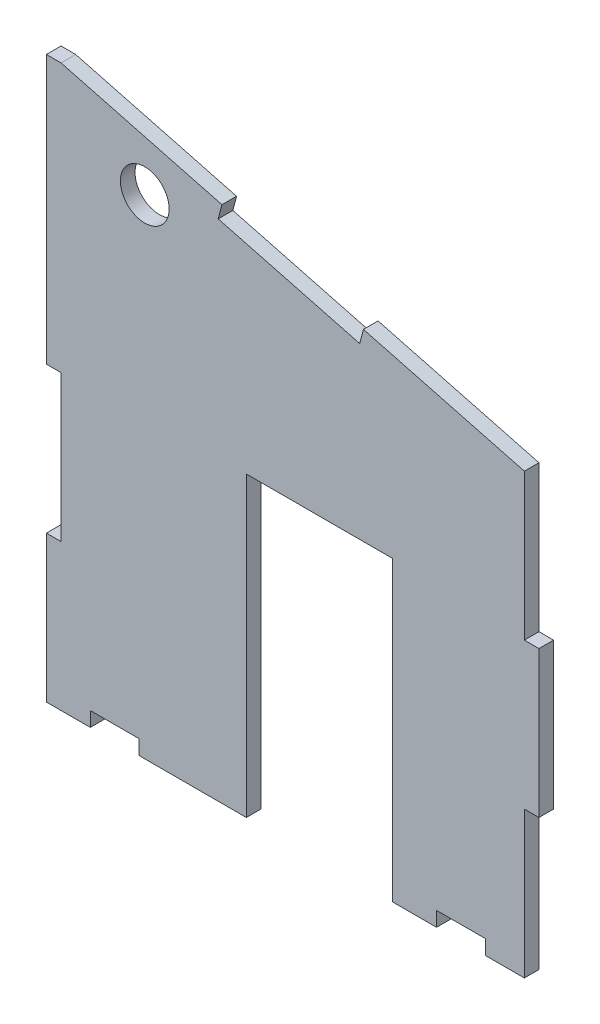
ISO-10303-21;
HEADER;
FILE_DESCRIPTION(('STEP AP214'),'2;1');
FILE_NAME('part.step','',(''),(''),'','','');
FILE_SCHEMA(('AUTOMOTIVE_DESIGN { 1 0 10303 214 1 1 1 1 }'));
ENDSEC;
DATA;
#1=APPLICATION_CONTEXT('core data for automotive mechanical design processes');
#2=APPLICATION_PROTOCOL_DEFINITION('international standard','automotive_design',2000,#1);
#3=PRODUCT_CONTEXT('',#1,'mechanical');
#4=PRODUCT('Part','Part','',(#3));
#5=PRODUCT_RELATED_PRODUCT_CATEGORY('part','',(#4));
#6=PRODUCT_DEFINITION_FORMATION('','',#4);
#7=PRODUCT_DEFINITION_CONTEXT('part definition',#1,'design');
#8=PRODUCT_DEFINITION('design','',#6,#7);
#9=PRODUCT_DEFINITION_SHAPE('','',#8);
#10=(LENGTH_UNIT() NAMED_UNIT(*) SI_UNIT(.MILLI.,.METRE.));
#11=(NAMED_UNIT(*) PLANE_ANGLE_UNIT() SI_UNIT($,.RADIAN.));
#12=(NAMED_UNIT(*) SI_UNIT($,.STERADIAN.) SOLID_ANGLE_UNIT());
#13=UNCERTAINTY_MEASURE_WITH_UNIT(LENGTH_MEASURE(1.E-05),#10,'distance_accuracy_value','');
#14=(GEOMETRIC_REPRESENTATION_CONTEXT(3) GLOBAL_UNCERTAINTY_ASSIGNED_CONTEXT((#13)) GLOBAL_UNIT_ASSIGNED_CONTEXT((#10,
#11,#12)) REPRESENTATION_CONTEXT('',''));
#15=CARTESIAN_POINT('',(0.,0.,0.));
#16=DIRECTION('',(0.,0.,1.));
#17=DIRECTION('',(1.,0.,0.));
#18=AXIS2_PLACEMENT_3D('',#15,#16,#17);
#19=CARTESIAN_POINT('',(0.,0.,3.));
#20=DIRECTION('',(0.,0.,1.));
#21=DIRECTION('',(1.,0.,0.));
#22=AXIS2_PLACEMENT_3D('',#19,#20,#21);
#23=PLANE('',#22);
#24=DIRECTION('',(-0.967074537262647,0.254493299279643,0.));
#25=VECTOR('',#24,1.);
#26=CARTESIAN_POINT('',(287.68406080118,245.441152462418,3.));
#27=LINE('',#26,#25);
#28=CARTESIAN_POINT('',(287.68406080118,245.441152462418,3.));
#29=VERTEX_POINT('',#28);
#30=CARTESIAN_POINT('',(254.690178860119,254.123752973223,3.));
#31=VERTEX_POINT('',#30);
#32=EDGE_CURVE('E315',#29,#31,#27,.T.);
#33=ORIENTED_EDGE('',*,*,#32,.T.);
#34=DIRECTION('',(-1.,0.,0.));
#35=VECTOR('',#34,1.);
#36=CARTESIAN_POINT('',(251.69017886012,254.123752973223,3.));
#37=LINE('',#36,#35);
#38=CARTESIAN_POINT('',(251.69017886012,254.123752973223,3.));
#39=VERTEX_POINT('',#38);
#40=EDGE_CURVE('E158',#31,#39,#37,.T.);
#41=ORIENTED_EDGE('',*,*,#40,.T.);
#42=DIRECTION('',(0.,-1.,0.));
#43=VECTOR('',#42,1.);
#44=CARTESIAN_POINT('',(251.69017886012,254.123752973223,3.));
#45=LINE('',#44,#43);
#46=CARTESIAN_POINT('',(251.69017886012,199.123752973223,3.));
#47=VERTEX_POINT('',#46);
#48=EDGE_CURVE('E393',#39,#47,#45,.T.);
#49=ORIENTED_EDGE('',*,*,#48,.T.);
#50=DIRECTION('',(1.,0.,0.));
#51=VECTOR('',#50,1.);
#52=CARTESIAN_POINT('',(251.69017886012,199.123752973223,3.));
#53=LINE('',#52,#51);
#54=CARTESIAN_POINT('',(254.690178860119,199.123752973223,3.));
#55=VERTEX_POINT('',#54);
#56=EDGE_CURVE('E412',#47,#55,#53,.T.);
#57=ORIENTED_EDGE('',*,*,#56,.T.);
#58=DIRECTION('',(0.,-1.,0.));
#59=VECTOR('',#58,1.);
#60=CARTESIAN_POINT('',(254.690178860119,199.123752973223,3.));
#61=LINE('',#60,#59);
#62=CARTESIAN_POINT('',(254.690178860119,169.123752973223,3.));
#63=VERTEX_POINT('',#62);
#64=EDGE_CURVE('E409',#55,#63,#61,.T.);
#65=ORIENTED_EDGE('',*,*,#64,.T.);
#66=DIRECTION('',(-1.,0.,0.));
#67=VECTOR('',#66,1.);
#68=CARTESIAN_POINT('',(254.690178860119,169.123752973223,3.));
#69=LINE('',#68,#67);
#70=CARTESIAN_POINT('',(251.690178860119,169.123752973223,3.));
#71=VERTEX_POINT('',#70);
#72=EDGE_CURVE('E411',#63,#71,#69,.T.);
#73=ORIENTED_EDGE('',*,*,#72,.T.);
#74=DIRECTION('',(0.,-1.,0.));
#75=VECTOR('',#74,1.);
#76=CARTESIAN_POINT('',(251.690178860119,169.123752973223,3.));
#77=LINE('',#76,#75);
#78=CARTESIAN_POINT('',(251.690178860119,139.123752973223,3.));
#79=VERTEX_POINT('',#78);
#80=EDGE_CURVE('E414',#71,#79,#77,.T.);
#81=ORIENTED_EDGE('',*,*,#80,.T.);
#82=DIRECTION('',(1.,0.,0.));
#83=VECTOR('',#82,1.);
#84=CARTESIAN_POINT('',(251.690178860119,139.123752973223,3.));
#85=LINE('',#84,#83);
#86=CARTESIAN_POINT('',(260.690178860119,139.123752973223,3.));
#87=VERTEX_POINT('',#86);
#88=EDGE_CURVE('E420',#79,#87,#85,.T.);
#89=ORIENTED_EDGE('',*,*,#88,.T.);
#90=DIRECTION('',(0.,1.,0.));
#91=VECTOR('',#90,1.);
#92=CARTESIAN_POINT('',(260.690178860119,139.123752973223,3.));
#93=LINE('',#92,#91);
#94=CARTESIAN_POINT('',(260.690178860119,142.123752973223,3.));
#95=VERTEX_POINT('',#94);
#96=EDGE_CURVE('E422',#87,#95,#93,.T.);
#97=ORIENTED_EDGE('',*,*,#96,.T.);
#98=DIRECTION('',(1.,0.,0.));
#99=VECTOR('',#98,1.);
#100=CARTESIAN_POINT('',(260.690178860119,142.123752973223,3.));
#101=LINE('',#100,#99);
#102=CARTESIAN_POINT('',(270.690178860119,142.123752973223,3.));
#103=VERTEX_POINT('',#102);
#104=EDGE_CURVE('E424',#95,#103,#101,.T.);
#105=ORIENTED_EDGE('',*,*,#104,.T.);
#106=DIRECTION('',(0.,-1.,0.));
#107=VECTOR('',#106,1.);
#108=CARTESIAN_POINT('',(270.690178860119,142.123752973223,3.));
#109=LINE('',#108,#107);
#110=CARTESIAN_POINT('',(270.690178860119,139.123752973223,3.));
#111=VERTEX_POINT('',#110);
#112=EDGE_CURVE('E426',#103,#111,#109,.T.);
#113=ORIENTED_EDGE('',*,*,#112,.T.);
#114=DIRECTION('',(1.,0.,0.));
#115=VECTOR('',#114,1.);
#116=CARTESIAN_POINT('',(270.690178860119,139.123752973223,3.));
#117=LINE('',#116,#115);
#118=CARTESIAN_POINT('',(292.690178860119,139.123752973223,3.));
#119=VERTEX_POINT('',#118);
#120=EDGE_CURVE('E428',#111,#119,#117,.T.);
#121=ORIENTED_EDGE('',*,*,#120,.T.);
#122=DIRECTION('',(0.,1.,0.));
#123=VECTOR('',#122,1.);
#124=CARTESIAN_POINT('',(292.690178860119,200.123752973223,3.));
#125=LINE('',#124,#123);
#126=CARTESIAN_POINT('',(292.690178860119,200.123752973223,3.));
#127=VERTEX_POINT('',#126);
#128=EDGE_CURVE('E430',#119,#127,#125,.T.);
#129=ORIENTED_EDGE('',*,*,#128,.T.);
#130=DIRECTION('',(1.,0.,0.));
#131=VECTOR('',#130,1.);
#132=CARTESIAN_POINT('',(322.690178860119,200.123752973223,3.));
#133=LINE('',#132,#131);
#134=CARTESIAN_POINT('',(322.690178860119,200.123752973223,3.));
#135=VERTEX_POINT('',#134);
#136=EDGE_CURVE('E432',#127,#135,#133,.T.);
#137=ORIENTED_EDGE('',*,*,#136,.T.);
#138=DIRECTION('',(0.,-1.,0.));
#139=VECTOR('',#138,1.);
#140=CARTESIAN_POINT('',(322.690178860119,139.123752973223,3.));
#141=LINE('',#140,#139);
#142=CARTESIAN_POINT('',(322.690178860119,139.123752973223,3.));
#143=VERTEX_POINT('',#142);
#144=EDGE_CURVE('E434',#135,#143,#141,.T.);
#145=ORIENTED_EDGE('',*,*,#144,.T.);
#146=DIRECTION('',(1.,0.,0.));
#147=VECTOR('',#146,1.);
#148=CARTESIAN_POINT('',(331.690178860119,139.123752973223,3.));
#149=LINE('',#148,#147);
#150=CARTESIAN_POINT('',(331.690178860119,139.123752973223,3.));
#151=VERTEX_POINT('',#150);
#152=EDGE_CURVE('E436',#143,#151,#149,.T.);
#153=ORIENTED_EDGE('',*,*,#152,.T.);
#154=DIRECTION('',(0.,1.,0.));
#155=VECTOR('',#154,1.);
#156=CARTESIAN_POINT('',(331.690178860119,142.123752973223,3.));
#157=LINE('',#156,#155);
#158=CARTESIAN_POINT('',(331.690178860119,142.123752973223,3.));
#159=VERTEX_POINT('',#158);
#160=EDGE_CURVE('E438',#151,#159,#157,.T.);
#161=ORIENTED_EDGE('',*,*,#160,.T.);
#162=DIRECTION('',(1.,0.,0.));
#163=VECTOR('',#162,1.);
#164=CARTESIAN_POINT('',(341.690178860119,142.123752973223,3.));
#165=LINE('',#164,#163);
#166=CARTESIAN_POINT('',(341.690178860119,142.123752973223,3.));
#167=VERTEX_POINT('',#166);
#168=EDGE_CURVE('E440',#159,#167,#165,.T.);
#169=ORIENTED_EDGE('',*,*,#168,.T.);
#170=DIRECTION('',(0.,-1.,0.));
#171=VECTOR('',#170,1.);
#172=CARTESIAN_POINT('',(341.690178860119,139.123752973223,3.));
#173=LINE('',#172,#171);
#174=CARTESIAN_POINT('',(341.690178860119,139.123752973223,3.));
#175=VERTEX_POINT('',#174);
#176=EDGE_CURVE('E442',#167,#175,#173,.T.);
#177=ORIENTED_EDGE('',*,*,#176,.T.);
#178=DIRECTION('',(1.,0.,0.));
#179=VECTOR('',#178,1.);
#180=CARTESIAN_POINT('',(349.690178860119,139.123752973223,3.));
#181=LINE('',#180,#179);
#182=CARTESIAN_POINT('',(349.690178860119,139.123752973223,3.));
#183=VERTEX_POINT('',#182);
#184=EDGE_CURVE('E444',#175,#183,#181,.T.);
#185=ORIENTED_EDGE('',*,*,#184,.T.);
#186=DIRECTION('',(0.,1.,0.));
#187=VECTOR('',#186,1.);
#188=CARTESIAN_POINT('',(349.690178860119,169.123752973223,3.));
#189=LINE('',#188,#187);
#190=CARTESIAN_POINT('',(349.690178860119,169.123752973223,3.));
#191=VERTEX_POINT('',#190);
#192=EDGE_CURVE('E446',#183,#191,#189,.T.);
#193=ORIENTED_EDGE('',*,*,#192,.T.);
#194=DIRECTION('',(1.,0.,0.));
#195=VECTOR('',#194,1.);
#196=CARTESIAN_POINT('',(352.690178860119,169.123752973223,3.));
#197=LINE('',#196,#195);
#198=CARTESIAN_POINT('',(352.690178860119,169.123752973223,3.));
#199=VERTEX_POINT('',#198);
#200=EDGE_CURVE('E448',#191,#199,#197,.T.);
#201=ORIENTED_EDGE('',*,*,#200,.T.);
#202=DIRECTION('',(0.,1.,0.));
#203=VECTOR('',#202,1.);
#204=CARTESIAN_POINT('',(352.690178860119,199.123752973223,3.));
#205=LINE('',#204,#203);
#206=CARTESIAN_POINT('',(352.690178860119,199.123752973223,3.));
#207=VERTEX_POINT('',#206);
#208=EDGE_CURVE('E450',#199,#207,#205,.T.);
#209=ORIENTED_EDGE('',*,*,#208,.T.);
#210=DIRECTION('',(-1.,0.,0.));
#211=VECTOR('',#210,1.);
#212=CARTESIAN_POINT('',(349.690178860119,199.123752973223,3.));
#213=LINE('',#212,#211);
#214=CARTESIAN_POINT('',(349.690178860119,199.123752973223,3.));
#215=VERTEX_POINT('',#214);
#216=EDGE_CURVE('E452',#207,#215,#213,.T.);
#217=ORIENTED_EDGE('',*,*,#216,.T.);
#218=DIRECTION('',(0.,1.,0.));
#219=VECTOR('',#218,1.);
#220=CARTESIAN_POINT('',(349.690178860119,229.123752973223,3.));
#221=LINE('',#220,#219);
#222=CARTESIAN_POINT('',(349.690178860119,229.123752973223,3.));
#223=VERTEX_POINT('',#222);
#224=EDGE_CURVE('E454',#215,#223,#221,.T.);
#225=ORIENTED_EDGE('',*,*,#224,.T.);
#226=DIRECTION('',(-0.967074537262646,0.254493299279645,0.));
#227=VECTOR('',#226,1.);
#228=CARTESIAN_POINT('',(349.690178860119,229.123752973223,3.));
#229=LINE('',#228,#227);
#230=CARTESIAN_POINT('',(316.696296919059,237.806353484029,3.));
#231=VERTEX_POINT('',#230);
#232=EDGE_CURVE('E240',#223,#231,#229,.T.);
#233=ORIENTED_EDGE('',*,*,#232,.T.);
#234=DIRECTION('',(-0.254493299279655,-0.967074537262643,0.));
#235=VECTOR('',#234,1.);
#236=CARTESIAN_POINT('',(316.696296919059,237.806353484029,3.));
#237=LINE('',#236,#235);
#238=CARTESIAN_POINT('',(315.93281702122,234.905129872241,3.));
#239=VERTEX_POINT('',#238);
#240=EDGE_CURVE('E234',#231,#239,#237,.T.);
#241=ORIENTED_EDGE('',*,*,#240,.T.);
#242=DIRECTION('',(-0.967074537262646,0.254493299279644,0.));
#243=VECTOR('',#242,1.);
#244=CARTESIAN_POINT('',(315.93281702122,234.905129872241,3.));
#245=LINE('',#244,#243);
#246=CARTESIAN_POINT('',(286.920580903341,242.53992885063,3.));
#247=VERTEX_POINT('',#246);
#248=EDGE_CURVE('E238',#239,#247,#245,.T.);
#249=ORIENTED_EDGE('',*,*,#248,.T.);
#250=DIRECTION('',(0.254493299279655,0.967074537262643,0.));
#251=VECTOR('',#250,1.);
#252=CARTESIAN_POINT('',(287.68406080118,245.441152462418,3.));
#253=LINE('',#252,#251);
#254=EDGE_CURVE('E52',#247,#29,#253,.T.);
#255=ORIENTED_EDGE('',*,*,#254,.T.);
#256=EDGE_LOOP('',(#33,#41,#49,#57,#65,#73,#81,#89,#97,#105,#113,#121,#129,#137,#145,#153,#161,
#169,#177,#185,#193,#201,#209,#217,#225,#233,#241,#249,#255));
#257=FACE_BOUND('',#256,.T.);
#258=CARTESIAN_POINT('',(271.859853832682,239.264952872871,3.));
#259=DIRECTION('',(0.,0.,1.));
#260=DIRECTION('',(1.,0.,0.));
#261=AXIS2_PLACEMENT_3D('',#258,#259,#260);
#262=CIRCLE('',#261,4.99999999999999);
#263=CARTESIAN_POINT('',(276.859853832682,239.264952872871,3.));
#264=VERTEX_POINT('',#263);
#265=EDGE_CURVE('E262',#264,#264,#262,.T.);
#266=ORIENTED_EDGE('',*,*,#265,.F.);
#267=EDGE_LOOP('',(#266));
#268=FACE_BOUND('',#267,.T.);
#269=ADVANCED_FACE('F35',(#257,#268),#23,.T.);
#270=CARTESIAN_POINT('',(0.,0.,0.));
#271=DIRECTION('',(0.,0.,1.));
#272=DIRECTION('',(1.,0.,0.));
#273=AXIS2_PLACEMENT_3D('',#270,#271,#272);
#274=PLANE('',#273);
#275=DIRECTION('',(-0.967074537262647,0.254493299279643,0.));
#276=VECTOR('',#275,1.);
#277=CARTESIAN_POINT('',(287.68406080118,245.441152462418,0.));
#278=LINE('',#277,#276);
#279=CARTESIAN_POINT('',(287.68406080118,245.441152462418,0.));
#280=VERTEX_POINT('',#279);
#281=CARTESIAN_POINT('',(254.690178860119,254.123752973223,0.));
#282=VERTEX_POINT('',#281);
#283=EDGE_CURVE('E258',#280,#282,#278,.T.);
#284=ORIENTED_EDGE('',*,*,#283,.F.);
#285=DIRECTION('',(0.254493299279655,0.967074537262643,0.));
#286=VECTOR('',#285,1.);
#287=CARTESIAN_POINT('',(287.68406080118,245.441152462418,0.));
#288=LINE('',#287,#286);
#289=CARTESIAN_POINT('',(286.920580903341,242.53992885063,0.));
#290=VERTEX_POINT('',#289);
#291=EDGE_CURVE('E150',#290,#280,#288,.T.);
#292=ORIENTED_EDGE('',*,*,#291,.F.);
#293=DIRECTION('',(-0.967074537262646,0.254493299279644,0.));
#294=VECTOR('',#293,1.);
#295=CARTESIAN_POINT('',(315.93281702122,234.905129872241,0.));
#296=LINE('',#295,#294);
#297=CARTESIAN_POINT('',(315.93281702122,234.905129872241,0.));
#298=VERTEX_POINT('',#297);
#299=EDGE_CURVE('E144',#298,#290,#296,.T.);
#300=ORIENTED_EDGE('',*,*,#299,.F.);
#301=DIRECTION('',(-0.254493299279655,-0.967074537262643,0.));
#302=VECTOR('',#301,1.);
#303=CARTESIAN_POINT('',(316.696296919059,237.806353484029,0.));
#304=LINE('',#303,#302);
#305=CARTESIAN_POINT('',(316.696296919059,237.806353484029,0.));
#306=VERTEX_POINT('',#305);
#307=EDGE_CURVE('E248',#306,#298,#304,.T.);
#308=ORIENTED_EDGE('',*,*,#307,.F.);
#309=DIRECTION('',(-0.967074537262646,0.254493299279645,0.));
#310=VECTOR('',#309,1.);
#311=CARTESIAN_POINT('',(349.690178860119,229.123752973223,0.));
#312=LINE('',#311,#310);
#313=CARTESIAN_POINT('',(349.690178860119,229.123752973223,0.));
#314=VERTEX_POINT('',#313);
#315=EDGE_CURVE('E310',#314,#306,#312,.T.);
#316=ORIENTED_EDGE('',*,*,#315,.F.);
#317=DIRECTION('',(0.,1.,0.));
#318=VECTOR('',#317,1.);
#319=CARTESIAN_POINT('',(349.690178860119,229.123752973223,0.));
#320=LINE('',#319,#318);
#321=CARTESIAN_POINT('',(349.690178860119,199.123752973223,0.));
#322=VERTEX_POINT('',#321);
#323=EDGE_CURVE('E308',#322,#314,#320,.T.);
#324=ORIENTED_EDGE('',*,*,#323,.F.);
#325=DIRECTION('',(-1.,0.,0.));
#326=VECTOR('',#325,1.);
#327=CARTESIAN_POINT('',(349.690178860119,199.123752973223,0.));
#328=LINE('',#327,#326);
#329=CARTESIAN_POINT('',(352.690178860119,199.123752973223,0.));
#330=VERTEX_POINT('',#329);
#331=EDGE_CURVE('E306',#330,#322,#328,.T.);
#332=ORIENTED_EDGE('',*,*,#331,.F.);
#333=DIRECTION('',(0.,1.,0.));
#334=VECTOR('',#333,1.);
#335=CARTESIAN_POINT('',(352.690178860119,199.123752973223,0.));
#336=LINE('',#335,#334);
#337=CARTESIAN_POINT('',(352.690178860119,169.123752973223,0.));
#338=VERTEX_POINT('',#337);
#339=EDGE_CURVE('E304',#338,#330,#336,.T.);
#340=ORIENTED_EDGE('',*,*,#339,.F.);
#341=DIRECTION('',(1.,0.,0.));
#342=VECTOR('',#341,1.);
#343=CARTESIAN_POINT('',(352.690178860119,169.123752973223,0.));
#344=LINE('',#343,#342);
#345=CARTESIAN_POINT('',(349.690178860119,169.123752973223,0.));
#346=VERTEX_POINT('',#345);
#347=EDGE_CURVE('E302',#346,#338,#344,.T.);
#348=ORIENTED_EDGE('',*,*,#347,.F.);
#349=DIRECTION('',(0.,1.,0.));
#350=VECTOR('',#349,1.);
#351=CARTESIAN_POINT('',(349.690178860119,169.123752973223,0.));
#352=LINE('',#351,#350);
#353=CARTESIAN_POINT('',(349.690178860119,139.123752973223,0.));
#354=VERTEX_POINT('',#353);
#355=EDGE_CURVE('E300',#354,#346,#352,.T.);
#356=ORIENTED_EDGE('',*,*,#355,.F.);
#357=DIRECTION('',(1.,0.,0.));
#358=VECTOR('',#357,1.);
#359=CARTESIAN_POINT('',(349.690178860119,139.123752973223,0.));
#360=LINE('',#359,#358);
#361=CARTESIAN_POINT('',(341.690178860119,139.123752973223,0.));
#362=VERTEX_POINT('',#361);
#363=EDGE_CURVE('E298',#362,#354,#360,.T.);
#364=ORIENTED_EDGE('',*,*,#363,.F.);
#365=DIRECTION('',(0.,-1.,0.));
#366=VECTOR('',#365,1.);
#367=CARTESIAN_POINT('',(341.690178860119,139.123752973223,0.));
#368=LINE('',#367,#366);
#369=CARTESIAN_POINT('',(341.690178860119,142.123752973223,0.));
#370=VERTEX_POINT('',#369);
#371=EDGE_CURVE('E296',#370,#362,#368,.T.);
#372=ORIENTED_EDGE('',*,*,#371,.F.);
#373=DIRECTION('',(1.,0.,0.));
#374=VECTOR('',#373,1.);
#375=CARTESIAN_POINT('',(341.690178860119,142.123752973223,0.));
#376=LINE('',#375,#374);
#377=CARTESIAN_POINT('',(331.690178860119,142.123752973223,0.));
#378=VERTEX_POINT('',#377);
#379=EDGE_CURVE('E294',#378,#370,#376,.T.);
#380=ORIENTED_EDGE('',*,*,#379,.F.);
#381=DIRECTION('',(0.,1.,0.));
#382=VECTOR('',#381,1.);
#383=CARTESIAN_POINT('',(331.690178860119,142.123752973223,0.));
#384=LINE('',#383,#382);
#385=CARTESIAN_POINT('',(331.690178860119,139.123752973223,0.));
#386=VERTEX_POINT('',#385);
#387=EDGE_CURVE('E292',#386,#378,#384,.T.);
#388=ORIENTED_EDGE('',*,*,#387,.F.);
#389=DIRECTION('',(1.,0.,0.));
#390=VECTOR('',#389,1.);
#391=CARTESIAN_POINT('',(331.690178860119,139.123752973223,0.));
#392=LINE('',#391,#390);
#393=CARTESIAN_POINT('',(322.690178860119,139.123752973223,0.));
#394=VERTEX_POINT('',#393);
#395=EDGE_CURVE('E290',#394,#386,#392,.T.);
#396=ORIENTED_EDGE('',*,*,#395,.F.);
#397=DIRECTION('',(0.,-1.,0.));
#398=VECTOR('',#397,1.);
#399=CARTESIAN_POINT('',(322.690178860119,139.123752973223,0.));
#400=LINE('',#399,#398);
#401=CARTESIAN_POINT('',(322.690178860119,200.123752973223,0.));
#402=VERTEX_POINT('',#401);
#403=EDGE_CURVE('E288',#402,#394,#400,.T.);
#404=ORIENTED_EDGE('',*,*,#403,.F.);
#405=DIRECTION('',(1.,0.,0.));
#406=VECTOR('',#405,1.);
#407=CARTESIAN_POINT('',(322.690178860119,200.123752973223,0.));
#408=LINE('',#407,#406);
#409=CARTESIAN_POINT('',(292.690178860119,200.123752973223,0.));
#410=VERTEX_POINT('',#409);
#411=EDGE_CURVE('E286',#410,#402,#408,.T.);
#412=ORIENTED_EDGE('',*,*,#411,.F.);
#413=DIRECTION('',(0.,1.,0.));
#414=VECTOR('',#413,1.);
#415=CARTESIAN_POINT('',(292.690178860119,200.123752973223,0.));
#416=LINE('',#415,#414);
#417=CARTESIAN_POINT('',(292.690178860119,139.123752973223,0.));
#418=VERTEX_POINT('',#417);
#419=EDGE_CURVE('E284',#418,#410,#416,.T.);
#420=ORIENTED_EDGE('',*,*,#419,.F.);
#421=DIRECTION('',(1.,0.,0.));
#422=VECTOR('',#421,1.);
#423=CARTESIAN_POINT('',(270.690178860119,139.123752973223,0.));
#424=LINE('',#423,#422);
#425=CARTESIAN_POINT('',(270.690178860119,139.123752973223,0.));
#426=VERTEX_POINT('',#425);
#427=EDGE_CURVE('E282',#426,#418,#424,.T.);
#428=ORIENTED_EDGE('',*,*,#427,.F.);
#429=DIRECTION('',(0.,-1.,0.));
#430=VECTOR('',#429,1.);
#431=CARTESIAN_POINT('',(270.690178860119,142.123752973223,0.));
#432=LINE('',#431,#430);
#433=CARTESIAN_POINT('',(270.690178860119,142.123752973223,0.));
#434=VERTEX_POINT('',#433);
#435=EDGE_CURVE('E280',#434,#426,#432,.T.);
#436=ORIENTED_EDGE('',*,*,#435,.F.);
#437=DIRECTION('',(1.,0.,0.));
#438=VECTOR('',#437,1.);
#439=CARTESIAN_POINT('',(260.690178860119,142.123752973223,0.));
#440=LINE('',#439,#438);
#441=CARTESIAN_POINT('',(260.690178860119,142.123752973223,0.));
#442=VERTEX_POINT('',#441);
#443=EDGE_CURVE('E278',#442,#434,#440,.T.);
#444=ORIENTED_EDGE('',*,*,#443,.F.);
#445=DIRECTION('',(0.,1.,0.));
#446=VECTOR('',#445,1.);
#447=CARTESIAN_POINT('',(260.690178860119,139.123752973223,0.));
#448=LINE('',#447,#446);
#449=CARTESIAN_POINT('',(260.690178860119,139.123752973223,0.));
#450=VERTEX_POINT('',#449);
#451=EDGE_CURVE('E276',#450,#442,#448,.T.);
#452=ORIENTED_EDGE('',*,*,#451,.F.);
#453=DIRECTION('',(1.,0.,0.));
#454=VECTOR('',#453,1.);
#455=CARTESIAN_POINT('',(251.690178860119,139.123752973223,0.));
#456=LINE('',#455,#454);
#457=CARTESIAN_POINT('',(251.690178860119,139.123752973223,0.));
#458=VERTEX_POINT('',#457);
#459=EDGE_CURVE('E274',#458,#450,#456,.T.);
#460=ORIENTED_EDGE('',*,*,#459,.F.);
#461=DIRECTION('',(0.,-1.,0.));
#462=VECTOR('',#461,1.);
#463=CARTESIAN_POINT('',(251.690178860119,169.123752973223,0.));
#464=LINE('',#463,#462);
#465=CARTESIAN_POINT('',(251.690178860119,169.123752973223,0.));
#466=VERTEX_POINT('',#465);
#467=EDGE_CURVE('E272',#466,#458,#464,.T.);
#468=ORIENTED_EDGE('',*,*,#467,.F.);
#469=DIRECTION('',(-1.,0.,0.));
#470=VECTOR('',#469,1.);
#471=CARTESIAN_POINT('',(254.690178860119,169.123752973223,0.));
#472=LINE('',#471,#470);
#473=CARTESIAN_POINT('',(254.690178860119,169.123752973223,0.));
#474=VERTEX_POINT('',#473);
#475=EDGE_CURVE('E270',#474,#466,#472,.T.);
#476=ORIENTED_EDGE('',*,*,#475,.F.);
#477=DIRECTION('',(0.,-1.,0.));
#478=VECTOR('',#477,1.);
#479=CARTESIAN_POINT('',(254.690178860119,199.123752973223,0.));
#480=LINE('',#479,#478);
#481=CARTESIAN_POINT('',(254.690178860119,199.123752973223,0.));
#482=VERTEX_POINT('',#481);
#483=EDGE_CURVE('E268',#482,#474,#480,.T.);
#484=ORIENTED_EDGE('',*,*,#483,.F.);
#485=DIRECTION('',(1.,0.,0.));
#486=VECTOR('',#485,1.);
#487=CARTESIAN_POINT('',(251.69017886012,199.123752973223,0.));
#488=LINE('',#487,#486);
#489=CARTESIAN_POINT('',(251.69017886012,199.123752973223,0.));
#490=VERTEX_POINT('',#489);
#491=EDGE_CURVE('E266',#490,#482,#488,.T.);
#492=ORIENTED_EDGE('',*,*,#491,.F.);
#493=DIRECTION('',(0.,-1.,0.));
#494=VECTOR('',#493,1.);
#495=CARTESIAN_POINT('',(251.69017886012,254.123752973223,0.));
#496=LINE('',#495,#494);
#497=CARTESIAN_POINT('',(251.69017886012,254.123752973223,0.));
#498=VERTEX_POINT('',#497);
#499=EDGE_CURVE('E264',#498,#490,#496,.T.);
#500=ORIENTED_EDGE('',*,*,#499,.F.);
#501=DIRECTION('',(-1.,0.,0.));
#502=VECTOR('',#501,1.);
#503=CARTESIAN_POINT('',(251.69017886012,254.123752973223,0.));
#504=LINE('',#503,#502);
#505=EDGE_CURVE('E261',#282,#498,#504,.T.);
#506=ORIENTED_EDGE('',*,*,#505,.F.);
#507=EDGE_LOOP('',(#284,#292,#300,#308,#316,#324,#332,#340,#348,#356,#364,#372,#380,#388,#396,
#404,#412,#420,#428,#436,#444,#452,#460,#468,#476,#484,#492,#500,#506));
#508=FACE_BOUND('',#507,.T.);
#509=CARTESIAN_POINT('',(271.859853832682,239.264952872871,0.));
#510=DIRECTION('',(0.,0.,1.));
#511=DIRECTION('',(1.,0.,0.));
#512=AXIS2_PLACEMENT_3D('',#509,#510,#511);
#513=CIRCLE('',#512,4.99999999999999);
#514=CARTESIAN_POINT('',(276.859853832682,239.264952872871,0.));
#515=VERTEX_POINT('',#514);
#516=EDGE_CURVE('E828',#515,#515,#513,.T.);
#517=ORIENTED_EDGE('',*,*,#516,.T.);
#518=EDGE_LOOP('',(#517));
#519=FACE_BOUND('',#518,.T.);
#520=ADVANCED_FACE('F397',(#508,#519),#274,.F.);
#521=CARTESIAN_POINT('',(287.68406080118,245.441152462418,3.));
#522=DIRECTION('',(-0.254493299279643,-0.967074537262647,0.));
#523=DIRECTION('',(0.967074537262647,-0.254493299279643,0.));
#524=AXIS2_PLACEMENT_3D('',#521,#522,#523);
#525=PLANE('',#524);
#526=ORIENTED_EDGE('',*,*,#283,.T.);
#527=DIRECTION('',(0.,0.,-1.));
#528=VECTOR('',#527,1.);
#529=CARTESIAN_POINT('',(254.690178860119,254.123752973223,3.));
#530=LINE('',#529,#528);
#531=EDGE_CURVE('E11',#31,#282,#530,.T.);
#532=ORIENTED_EDGE('',*,*,#531,.F.);
#533=ORIENTED_EDGE('',*,*,#32,.F.);
#534=DIRECTION('',(0.,0.,-1.));
#535=VECTOR('',#534,1.);
#536=CARTESIAN_POINT('',(287.68406080118,245.441152462418,3.));
#537=LINE('',#536,#535);
#538=EDGE_CURVE('E254',#29,#280,#537,.T.);
#539=ORIENTED_EDGE('',*,*,#538,.T.);
#540=EDGE_LOOP('',(#526,#532,#533,#539));
#541=FACE_BOUND('',#540,.T.);
#542=ADVANCED_FACE('F37',(#541),#525,.F.);
#543=CARTESIAN_POINT('',(251.69017886012,254.123752973223,3.));
#544=DIRECTION('',(0.,-1.,0.));
#545=DIRECTION('',(0.,0.,-1.));
#546=AXIS2_PLACEMENT_3D('',#543,#544,#545);
#547=PLANE('',#546);
#548=ORIENTED_EDGE('',*,*,#505,.T.);
#549=DIRECTION('',(0.,0.,-1.));
#550=VECTOR('',#549,1.);
#551=CARTESIAN_POINT('',(251.69017886012,254.123752973223,3.));
#552=LINE('',#551,#550);
#553=EDGE_CURVE('E44',#39,#498,#552,.T.);
#554=ORIENTED_EDGE('',*,*,#553,.F.);
#555=ORIENTED_EDGE('',*,*,#40,.F.);
#556=ORIENTED_EDGE('',*,*,#531,.T.);
#557=EDGE_LOOP('',(#548,#554,#555,#556));
#558=FACE_BOUND('',#557,.T.);
#559=ADVANCED_FACE('F488',(#558),#547,.F.);
#560=CARTESIAN_POINT('',(251.69017886012,254.123752973223,3.));
#561=DIRECTION('',(1.,0.,0.));
#562=DIRECTION('',(0.,0.,-1.));
#563=AXIS2_PLACEMENT_3D('',#560,#561,#562);
#564=PLANE('',#563);
#565=ORIENTED_EDGE('',*,*,#499,.T.);
#566=DIRECTION('',(0.,0.,-1.));
#567=VECTOR('',#566,1.);
#568=CARTESIAN_POINT('',(251.69017886012,199.123752973223,3.));
#569=LINE('',#568,#567);
#570=EDGE_CURVE('E385',#47,#490,#569,.T.);
#571=ORIENTED_EDGE('',*,*,#570,.F.);
#572=ORIENTED_EDGE('',*,*,#48,.F.);
#573=ORIENTED_EDGE('',*,*,#553,.T.);
#574=EDGE_LOOP('',(#565,#571,#572,#573));
#575=FACE_BOUND('',#574,.T.);
#576=ADVANCED_FACE('F391',(#575),#564,.F.);
#577=CARTESIAN_POINT('',(251.69017886012,199.123752973223,3.));
#578=DIRECTION('',(0.,1.,0.));
#579=DIRECTION('',(0.,0.,1.));
#580=AXIS2_PLACEMENT_3D('',#577,#578,#579);
#581=PLANE('',#580);
#582=ORIENTED_EDGE('',*,*,#491,.T.);
#583=DIRECTION('',(0.,0.,-1.));
#584=VECTOR('',#583,1.);
#585=CARTESIAN_POINT('',(254.690178860119,199.123752973223,3.));
#586=LINE('',#585,#584);
#587=EDGE_CURVE('E382',#55,#482,#586,.T.);
#588=ORIENTED_EDGE('',*,*,#587,.F.);
#589=ORIENTED_EDGE('',*,*,#56,.F.);
#590=ORIENTED_EDGE('',*,*,#570,.T.);
#591=EDGE_LOOP('',(#582,#588,#589,#590));
#592=FACE_BOUND('',#591,.T.);
#593=ADVANCED_FACE('F403',(#592),#581,.F.);
#594=CARTESIAN_POINT('',(254.690178860119,199.123752973223,3.));
#595=DIRECTION('',(1.,0.,0.));
#596=DIRECTION('',(0.,0.,-1.));
#597=AXIS2_PLACEMENT_3D('',#594,#595,#596);
#598=PLANE('',#597);
#599=ORIENTED_EDGE('',*,*,#483,.T.);
#600=DIRECTION('',(0.,0.,-1.));
#601=VECTOR('',#600,1.);
#602=CARTESIAN_POINT('',(254.690178860119,169.123752973223,3.));
#603=LINE('',#602,#601);
#604=EDGE_CURVE('E379',#63,#474,#603,.T.);
#605=ORIENTED_EDGE('',*,*,#604,.F.);
#606=ORIENTED_EDGE('',*,*,#64,.F.);
#607=ORIENTED_EDGE('',*,*,#587,.T.);
#608=EDGE_LOOP('',(#599,#605,#606,#607));
#609=FACE_BOUND('',#608,.T.);
#610=ADVANCED_FACE('F407',(#609),#598,.F.);
#611=CARTESIAN_POINT('',(254.690178860119,169.123752973223,3.));
#612=DIRECTION('',(0.,-1.,0.));
#613=DIRECTION('',(0.,0.,-1.));
#614=AXIS2_PLACEMENT_3D('',#611,#612,#613);
#615=PLANE('',#614);
#616=ORIENTED_EDGE('',*,*,#475,.T.);
#617=DIRECTION('',(0.,0.,-1.));
#618=VECTOR('',#617,1.);
#619=CARTESIAN_POINT('',(251.690178860119,169.123752973223,3.));
#620=LINE('',#619,#618);
#621=EDGE_CURVE('E376',#71,#466,#620,.T.);
#622=ORIENTED_EDGE('',*,*,#621,.F.);
#623=ORIENTED_EDGE('',*,*,#72,.F.);
#624=ORIENTED_EDGE('',*,*,#604,.T.);
#625=EDGE_LOOP('',(#616,#622,#623,#624));
#626=FACE_BOUND('',#625,.T.);
#627=ADVANCED_FACE('F501',(#626),#615,.F.);
#628=CARTESIAN_POINT('',(251.690178860119,169.123752973223,3.));
#629=DIRECTION('',(1.,0.,0.));
#630=DIRECTION('',(0.,0.,-1.));
#631=AXIS2_PLACEMENT_3D('',#628,#629,#630);
#632=PLANE('',#631);
#633=ORIENTED_EDGE('',*,*,#467,.T.);
#634=DIRECTION('',(0.,0.,-1.));
#635=VECTOR('',#634,1.);
#636=CARTESIAN_POINT('',(251.690178860119,139.123752973223,3.));
#637=LINE('',#636,#635);
#638=EDGE_CURVE('E373',#79,#458,#637,.T.);
#639=ORIENTED_EDGE('',*,*,#638,.F.);
#640=ORIENTED_EDGE('',*,*,#80,.F.);
#641=ORIENTED_EDGE('',*,*,#621,.T.);
#642=EDGE_LOOP('',(#633,#639,#640,#641));
#643=FACE_BOUND('',#642,.T.);
#644=ADVANCED_FACE('F504',(#643),#632,.F.);
#645=CARTESIAN_POINT('',(251.690178860119,139.123752973223,3.));
#646=DIRECTION('',(0.,1.,0.));
#647=DIRECTION('',(0.,0.,1.));
#648=AXIS2_PLACEMENT_3D('',#645,#646,#647);
#649=PLANE('',#648);
#650=ORIENTED_EDGE('',*,*,#459,.T.);
#651=DIRECTION('',(0.,0.,-1.));
#652=VECTOR('',#651,1.);
#653=CARTESIAN_POINT('',(260.690178860119,139.123752973223,3.));
#654=LINE('',#653,#652);
#655=EDGE_CURVE('E370',#87,#450,#654,.T.);
#656=ORIENTED_EDGE('',*,*,#655,.F.);
#657=ORIENTED_EDGE('',*,*,#88,.F.);
#658=ORIENTED_EDGE('',*,*,#638,.T.);
#659=EDGE_LOOP('',(#650,#656,#657,#658));
#660=FACE_BOUND('',#659,.T.);
#661=ADVANCED_FACE('F508',(#660),#649,.F.);
#662=CARTESIAN_POINT('',(260.690178860119,139.123752973223,3.));
#663=DIRECTION('',(-1.,0.,0.));
#664=DIRECTION('',(0.,0.,1.));
#665=AXIS2_PLACEMENT_3D('',#662,#663,#664);
#666=PLANE('',#665);
#667=ORIENTED_EDGE('',*,*,#451,.T.);
#668=DIRECTION('',(0.,0.,-1.));
#669=VECTOR('',#668,1.);
#670=CARTESIAN_POINT('',(260.690178860119,142.123752973223,3.));
#671=LINE('',#670,#669);
#672=EDGE_CURVE('E367',#95,#442,#671,.T.);
#673=ORIENTED_EDGE('',*,*,#672,.F.);
#674=ORIENTED_EDGE('',*,*,#96,.F.);
#675=ORIENTED_EDGE('',*,*,#655,.T.);
#676=EDGE_LOOP('',(#667,#673,#674,#675));
#677=FACE_BOUND('',#676,.T.);
#678=ADVANCED_FACE('F512',(#677),#666,.F.);
#679=CARTESIAN_POINT('',(260.690178860119,142.123752973223,3.));
#680=DIRECTION('',(0.,1.,0.));
#681=DIRECTION('',(0.,0.,1.));
#682=AXIS2_PLACEMENT_3D('',#679,#680,#681);
#683=PLANE('',#682);
#684=ORIENTED_EDGE('',*,*,#443,.T.);
#685=DIRECTION('',(0.,0.,-1.));
#686=VECTOR('',#685,1.);
#687=CARTESIAN_POINT('',(270.690178860119,142.123752973223,3.));
#688=LINE('',#687,#686);
#689=EDGE_CURVE('E364',#103,#434,#688,.T.);
#690=ORIENTED_EDGE('',*,*,#689,.F.);
#691=ORIENTED_EDGE('',*,*,#104,.F.);
#692=ORIENTED_EDGE('',*,*,#672,.T.);
#693=EDGE_LOOP('',(#684,#690,#691,#692));
#694=FACE_BOUND('',#693,.T.);
#695=ADVANCED_FACE('F516',(#694),#683,.F.);
#696=CARTESIAN_POINT('',(270.690178860119,142.123752973223,3.));
#697=DIRECTION('',(1.,0.,0.));
#698=DIRECTION('',(0.,0.,-1.));
#699=AXIS2_PLACEMENT_3D('',#696,#697,#698);
#700=PLANE('',#699);
#701=ORIENTED_EDGE('',*,*,#435,.T.);
#702=DIRECTION('',(0.,0.,-1.));
#703=VECTOR('',#702,1.);
#704=CARTESIAN_POINT('',(270.690178860119,139.123752973223,3.));
#705=LINE('',#704,#703);
#706=EDGE_CURVE('E361',#111,#426,#705,.T.);
#707=ORIENTED_EDGE('',*,*,#706,.F.);
#708=ORIENTED_EDGE('',*,*,#112,.F.);
#709=ORIENTED_EDGE('',*,*,#689,.T.);
#710=EDGE_LOOP('',(#701,#707,#708,#709));
#711=FACE_BOUND('',#710,.T.);
#712=ADVANCED_FACE('F520',(#711),#700,.F.);
#713=CARTESIAN_POINT('',(270.690178860119,139.123752973223,3.));
#714=DIRECTION('',(0.,1.,0.));
#715=DIRECTION('',(-1.,0.,0.));
#716=AXIS2_PLACEMENT_3D('',#713,#714,#715);
#717=PLANE('',#716);
#718=ORIENTED_EDGE('',*,*,#427,.T.);
#719=DIRECTION('',(0.,0.,-1.));
#720=VECTOR('',#719,1.);
#721=CARTESIAN_POINT('',(292.690178860119,139.123752973223,3.));
#722=LINE('',#721,#720);
#723=EDGE_CURVE('E358',#119,#418,#722,.T.);
#724=ORIENTED_EDGE('',*,*,#723,.F.);
#725=ORIENTED_EDGE('',*,*,#120,.F.);
#726=ORIENTED_EDGE('',*,*,#706,.T.);
#727=EDGE_LOOP('',(#718,#724,#725,#726));
#728=FACE_BOUND('',#727,.T.);
#729=ADVANCED_FACE('F524',(#728),#717,.F.);
#730=CARTESIAN_POINT('',(292.690178860119,200.123752973223,3.));
#731=DIRECTION('',(-1.,0.,0.));
#732=DIRECTION('',(0.,-1.,0.));
#733=AXIS2_PLACEMENT_3D('',#730,#731,#732);
#734=PLANE('',#733);
#735=ORIENTED_EDGE('',*,*,#419,.T.);
#736=DIRECTION('',(0.,0.,-1.));
#737=VECTOR('',#736,1.);
#738=CARTESIAN_POINT('',(292.690178860119,200.123752973223,3.));
#739=LINE('',#738,#737);
#740=EDGE_CURVE('E355',#127,#410,#739,.T.);
#741=ORIENTED_EDGE('',*,*,#740,.F.);
#742=ORIENTED_EDGE('',*,*,#128,.F.);
#743=ORIENTED_EDGE('',*,*,#723,.T.);
#744=EDGE_LOOP('',(#735,#741,#742,#743));
#745=FACE_BOUND('',#744,.T.);
#746=ADVANCED_FACE('F528',(#745),#734,.F.);
#747=CARTESIAN_POINT('',(322.690178860119,200.123752973223,3.));
#748=DIRECTION('',(0.,1.,0.));
#749=DIRECTION('',(0.,0.,1.));
#750=AXIS2_PLACEMENT_3D('',#747,#748,#749);
#751=PLANE('',#750);
#752=ORIENTED_EDGE('',*,*,#411,.T.);
#753=DIRECTION('',(0.,0.,-1.));
#754=VECTOR('',#753,1.);
#755=CARTESIAN_POINT('',(322.690178860119,200.123752973223,3.));
#756=LINE('',#755,#754);
#757=EDGE_CURVE('E352',#135,#402,#756,.T.);
#758=ORIENTED_EDGE('',*,*,#757,.F.);
#759=ORIENTED_EDGE('',*,*,#136,.F.);
#760=ORIENTED_EDGE('',*,*,#740,.T.);
#761=EDGE_LOOP('',(#752,#758,#759,#760));
#762=FACE_BOUND('',#761,.T.);
#763=ADVANCED_FACE('F532',(#762),#751,.F.);
#764=CARTESIAN_POINT('',(322.690178860119,139.123752973223,3.));
#765=DIRECTION('',(1.,0.,0.));
#766=DIRECTION('',(0.,0.,-1.));
#767=AXIS2_PLACEMENT_3D('',#764,#765,#766);
#768=PLANE('',#767);
#769=ORIENTED_EDGE('',*,*,#403,.T.);
#770=DIRECTION('',(0.,0.,-1.));
#771=VECTOR('',#770,1.);
#772=CARTESIAN_POINT('',(322.690178860119,139.123752973223,3.));
#773=LINE('',#772,#771);
#774=EDGE_CURVE('E349',#143,#394,#773,.T.);
#775=ORIENTED_EDGE('',*,*,#774,.F.);
#776=ORIENTED_EDGE('',*,*,#144,.F.);
#777=ORIENTED_EDGE('',*,*,#757,.T.);
#778=EDGE_LOOP('',(#769,#775,#776,#777));
#779=FACE_BOUND('',#778,.T.);
#780=ADVANCED_FACE('F536',(#779),#768,.F.);
#781=CARTESIAN_POINT('',(331.690178860119,139.123752973223,3.));
#782=DIRECTION('',(0.,1.,0.));
#783=DIRECTION('',(-1.,0.,0.));
#784=AXIS2_PLACEMENT_3D('',#781,#782,#783);
#785=PLANE('',#784);
#786=ORIENTED_EDGE('',*,*,#395,.T.);
#787=DIRECTION('',(0.,0.,-1.));
#788=VECTOR('',#787,1.);
#789=CARTESIAN_POINT('',(331.690178860119,139.123752973223,3.));
#790=LINE('',#789,#788);
#791=EDGE_CURVE('E346',#151,#386,#790,.T.);
#792=ORIENTED_EDGE('',*,*,#791,.F.);
#793=ORIENTED_EDGE('',*,*,#152,.F.);
#794=ORIENTED_EDGE('',*,*,#774,.T.);
#795=EDGE_LOOP('',(#786,#792,#793,#794));
#796=FACE_BOUND('',#795,.T.);
#797=ADVANCED_FACE('F540',(#796),#785,.F.);
#798=CARTESIAN_POINT('',(331.690178860119,142.123752973223,3.));
#799=DIRECTION('',(-1.,0.,0.));
#800=DIRECTION('',(0.,0.,1.));
#801=AXIS2_PLACEMENT_3D('',#798,#799,#800);
#802=PLANE('',#801);
#803=ORIENTED_EDGE('',*,*,#387,.T.);
#804=DIRECTION('',(0.,0.,-1.));
#805=VECTOR('',#804,1.);
#806=CARTESIAN_POINT('',(331.690178860119,142.123752973223,3.));
#807=LINE('',#806,#805);
#808=EDGE_CURVE('E343',#159,#378,#807,.T.);
#809=ORIENTED_EDGE('',*,*,#808,.F.);
#810=ORIENTED_EDGE('',*,*,#160,.F.);
#811=ORIENTED_EDGE('',*,*,#791,.T.);
#812=EDGE_LOOP('',(#803,#809,#810,#811));
#813=FACE_BOUND('',#812,.T.);
#814=ADVANCED_FACE('F544',(#813),#802,.F.);
#815=CARTESIAN_POINT('',(341.690178860119,142.123752973223,3.));
#816=DIRECTION('',(0.,1.,0.));
#817=DIRECTION('',(0.,0.,1.));
#818=AXIS2_PLACEMENT_3D('',#815,#816,#817);
#819=PLANE('',#818);
#820=ORIENTED_EDGE('',*,*,#379,.T.);
#821=DIRECTION('',(0.,0.,-1.));
#822=VECTOR('',#821,1.);
#823=CARTESIAN_POINT('',(341.690178860119,142.123752973223,3.));
#824=LINE('',#823,#822);
#825=EDGE_CURVE('E340',#167,#370,#824,.T.);
#826=ORIENTED_EDGE('',*,*,#825,.F.);
#827=ORIENTED_EDGE('',*,*,#168,.F.);
#828=ORIENTED_EDGE('',*,*,#808,.T.);
#829=EDGE_LOOP('',(#820,#826,#827,#828));
#830=FACE_BOUND('',#829,.T.);
#831=ADVANCED_FACE('F548',(#830),#819,.F.);
#832=CARTESIAN_POINT('',(341.690178860119,139.123752973223,3.));
#833=DIRECTION('',(1.,0.,0.));
#834=DIRECTION('',(0.,0.,-1.));
#835=AXIS2_PLACEMENT_3D('',#832,#833,#834);
#836=PLANE('',#835);
#837=ORIENTED_EDGE('',*,*,#371,.T.);
#838=DIRECTION('',(0.,0.,-1.));
#839=VECTOR('',#838,1.);
#840=CARTESIAN_POINT('',(341.690178860119,139.123752973223,3.));
#841=LINE('',#840,#839);
#842=EDGE_CURVE('E337',#175,#362,#841,.T.);
#843=ORIENTED_EDGE('',*,*,#842,.F.);
#844=ORIENTED_EDGE('',*,*,#176,.F.);
#845=ORIENTED_EDGE('',*,*,#825,.T.);
#846=EDGE_LOOP('',(#837,#843,#844,#845));
#847=FACE_BOUND('',#846,.T.);
#848=ADVANCED_FACE('F552',(#847),#836,.F.);
#849=CARTESIAN_POINT('',(349.690178860119,139.123752973223,3.));
#850=DIRECTION('',(0.,1.,0.));
#851=DIRECTION('',(-1.,0.,0.));
#852=AXIS2_PLACEMENT_3D('',#849,#850,#851);
#853=PLANE('',#852);
#854=ORIENTED_EDGE('',*,*,#363,.T.);
#855=DIRECTION('',(0.,0.,-1.));
#856=VECTOR('',#855,1.);
#857=CARTESIAN_POINT('',(349.690178860119,139.123752973223,3.));
#858=LINE('',#857,#856);
#859=EDGE_CURVE('E334',#183,#354,#858,.T.);
#860=ORIENTED_EDGE('',*,*,#859,.F.);
#861=ORIENTED_EDGE('',*,*,#184,.F.);
#862=ORIENTED_EDGE('',*,*,#842,.T.);
#863=EDGE_LOOP('',(#854,#860,#861,#862));
#864=FACE_BOUND('',#863,.T.);
#865=ADVANCED_FACE('F556',(#864),#853,.F.);
#866=CARTESIAN_POINT('',(349.690178860119,169.123752973223,3.));
#867=DIRECTION('',(-1.,0.,0.));
#868=DIRECTION('',(0.,0.,1.));
#869=AXIS2_PLACEMENT_3D('',#866,#867,#868);
#870=PLANE('',#869);
#871=ORIENTED_EDGE('',*,*,#355,.T.);
#872=DIRECTION('',(0.,0.,-1.));
#873=VECTOR('',#872,1.);
#874=CARTESIAN_POINT('',(349.690178860119,169.123752973223,3.));
#875=LINE('',#874,#873);
#876=EDGE_CURVE('E331',#191,#346,#875,.T.);
#877=ORIENTED_EDGE('',*,*,#876,.F.);
#878=ORIENTED_EDGE('',*,*,#192,.F.);
#879=ORIENTED_EDGE('',*,*,#859,.T.);
#880=EDGE_LOOP('',(#871,#877,#878,#879));
#881=FACE_BOUND('',#880,.T.);
#882=ADVANCED_FACE('F560',(#881),#870,.F.);
#883=CARTESIAN_POINT('',(352.690178860119,169.123752973223,3.));
#884=DIRECTION('',(0.,1.,0.));
#885=DIRECTION('',(-1.,0.,0.));
#886=AXIS2_PLACEMENT_3D('',#883,#884,#885);
#887=PLANE('',#886);
#888=ORIENTED_EDGE('',*,*,#347,.T.);
#889=DIRECTION('',(0.,0.,-1.));
#890=VECTOR('',#889,1.);
#891=CARTESIAN_POINT('',(352.690178860119,169.123752973223,3.));
#892=LINE('',#891,#890);
#893=EDGE_CURVE('E328',#199,#338,#892,.T.);
#894=ORIENTED_EDGE('',*,*,#893,.F.);
#895=ORIENTED_EDGE('',*,*,#200,.F.);
#896=ORIENTED_EDGE('',*,*,#876,.T.);
#897=EDGE_LOOP('',(#888,#894,#895,#896));
#898=FACE_BOUND('',#897,.T.);
#899=ADVANCED_FACE('F564',(#898),#887,.F.);
#900=CARTESIAN_POINT('',(352.690178860119,199.123752973223,3.));
#901=DIRECTION('',(-1.,0.,0.));
#902=DIRECTION('',(0.,0.,1.));
#903=AXIS2_PLACEMENT_3D('',#900,#901,#902);
#904=PLANE('',#903);
#905=ORIENTED_EDGE('',*,*,#339,.T.);
#906=DIRECTION('',(0.,0.,-1.));
#907=VECTOR('',#906,1.);
#908=CARTESIAN_POINT('',(352.690178860119,199.123752973223,3.));
#909=LINE('',#908,#907);
#910=EDGE_CURVE('E325',#207,#330,#909,.T.);
#911=ORIENTED_EDGE('',*,*,#910,.F.);
#912=ORIENTED_EDGE('',*,*,#208,.F.);
#913=ORIENTED_EDGE('',*,*,#893,.T.);
#914=EDGE_LOOP('',(#905,#911,#912,#913));
#915=FACE_BOUND('',#914,.T.);
#916=ADVANCED_FACE('F568',(#915),#904,.F.);
#917=CARTESIAN_POINT('',(349.690178860119,199.123752973223,3.));
#918=DIRECTION('',(0.,-1.,0.));
#919=DIRECTION('',(0.,0.,-1.));
#920=AXIS2_PLACEMENT_3D('',#917,#918,#919);
#921=PLANE('',#920);
#922=ORIENTED_EDGE('',*,*,#331,.T.);
#923=DIRECTION('',(0.,0.,-1.));
#924=VECTOR('',#923,1.);
#925=CARTESIAN_POINT('',(349.690178860119,199.123752973223,3.));
#926=LINE('',#925,#924);
#927=EDGE_CURVE('E322',#215,#322,#926,.T.);
#928=ORIENTED_EDGE('',*,*,#927,.F.);
#929=ORIENTED_EDGE('',*,*,#216,.F.);
#930=ORIENTED_EDGE('',*,*,#910,.T.);
#931=EDGE_LOOP('',(#922,#928,#929,#930));
#932=FACE_BOUND('',#931,.T.);
#933=ADVANCED_FACE('F572',(#932),#921,.F.);
#934=CARTESIAN_POINT('',(349.690178860119,229.123752973223,3.));
#935=DIRECTION('',(-1.,0.,0.));
#936=DIRECTION('',(0.,-1.,0.));
#937=AXIS2_PLACEMENT_3D('',#934,#935,#936);
#938=PLANE('',#937);
#939=ORIENTED_EDGE('',*,*,#323,.T.);
#940=DIRECTION('',(0.,0.,-1.));
#941=VECTOR('',#940,1.);
#942=CARTESIAN_POINT('',(349.690178860119,229.123752973223,3.));
#943=LINE('',#942,#941);
#944=EDGE_CURVE('E319',#223,#314,#943,.T.);
#945=ORIENTED_EDGE('',*,*,#944,.F.);
#946=ORIENTED_EDGE('',*,*,#224,.F.);
#947=ORIENTED_EDGE('',*,*,#927,.T.);
#948=EDGE_LOOP('',(#939,#945,#946,#947));
#949=FACE_BOUND('',#948,.T.);
#950=ADVANCED_FACE('F460',(#949),#938,.F.);
#951=CARTESIAN_POINT('',(349.690178860119,229.123752973223,3.));
#952=DIRECTION('',(-0.254493299279645,-0.967074537262646,0.));
#953=DIRECTION('',(0.967074537262646,-0.254493299279645,0.));
#954=AXIS2_PLACEMENT_3D('',#951,#952,#953);
#955=PLANE('',#954);
#956=ORIENTED_EDGE('',*,*,#315,.T.);
#957=DIRECTION('',(0.,0.,-1.));
#958=VECTOR('',#957,1.);
#959=CARTESIAN_POINT('',(316.696296919059,237.806353484029,3.));
#960=LINE('',#959,#958);
#961=EDGE_CURVE('E249',#231,#306,#960,.T.);
#962=ORIENTED_EDGE('',*,*,#961,.F.);
#963=ORIENTED_EDGE('',*,*,#232,.F.);
#964=ORIENTED_EDGE('',*,*,#944,.T.);
#965=EDGE_LOOP('',(#956,#962,#963,#964));
#966=FACE_BOUND('',#965,.T.);
#967=ADVANCED_FACE('F464',(#966),#955,.F.);
#968=CARTESIAN_POINT('',(316.696296919059,237.806353484029,3.));
#969=DIRECTION('',(0.967074537262643,-0.254493299279655,0.));
#970=DIRECTION('',(0.254493299279655,0.967074537262644,0.));
#971=AXIS2_PLACEMENT_3D('',#968,#969,#970);
#972=PLANE('',#971);
#973=ORIENTED_EDGE('',*,*,#307,.T.);
#974=DIRECTION('',(0.,0.,-1.));
#975=VECTOR('',#974,1.);
#976=CARTESIAN_POINT('',(315.93281702122,234.905129872241,3.));
#977=LINE('',#976,#975);
#978=EDGE_CURVE('E245',#239,#298,#977,.T.);
#979=ORIENTED_EDGE('',*,*,#978,.F.);
#980=ORIENTED_EDGE('',*,*,#240,.F.);
#981=ORIENTED_EDGE('',*,*,#961,.T.);
#982=EDGE_LOOP('',(#973,#979,#980,#981));
#983=FACE_BOUND('',#982,.T.);
#984=ADVANCED_FACE('F246',(#983),#972,.F.);
#985=CARTESIAN_POINT('',(315.93281702122,234.905129872241,3.));
#986=DIRECTION('',(-0.254493299279644,-0.967074537262646,0.));
#987=DIRECTION('',(0.967074537262646,-0.254493299279644,0.));
#988=AXIS2_PLACEMENT_3D('',#985,#986,#987);
#989=PLANE('',#988);
#990=ORIENTED_EDGE('',*,*,#299,.T.);
#991=DIRECTION('',(0.,0.,-1.));
#992=VECTOR('',#991,1.);
#993=CARTESIAN_POINT('',(286.920580903341,242.53992885063,3.));
#994=LINE('',#993,#992);
#995=EDGE_CURVE('E250',#247,#290,#994,.T.);
#996=ORIENTED_EDGE('',*,*,#995,.F.);
#997=ORIENTED_EDGE('',*,*,#248,.F.);
#998=ORIENTED_EDGE('',*,*,#978,.T.);
#999=EDGE_LOOP('',(#990,#996,#997,#998));
#1000=FACE_BOUND('',#999,.T.);
#1001=ADVANCED_FACE('F252',(#1000),#989,.F.);
#1002=CARTESIAN_POINT('',(287.68406080118,245.441152462418,3.));
#1003=DIRECTION('',(-0.967074537262643,0.254493299279655,0.));
#1004=DIRECTION('',(-0.254493299279655,-0.967074537262644,0.));
#1005=AXIS2_PLACEMENT_3D('',#1002,#1003,#1004);
#1006=PLANE('',#1005);
#1007=ORIENTED_EDGE('',*,*,#291,.T.);
#1008=ORIENTED_EDGE('',*,*,#538,.F.);
#1009=ORIENTED_EDGE('',*,*,#254,.F.);
#1010=ORIENTED_EDGE('',*,*,#995,.T.);
#1011=EDGE_LOOP('',(#1007,#1008,#1009,#1010));
#1012=FACE_BOUND('',#1011,.T.);
#1013=ADVANCED_FACE('F468',(#1012),#1006,.F.);
#1014=CARTESIAN_POINT('',(271.859853832682,239.264952872871,3.));
#1015=DIRECTION('',(0.,0.,-1.));
#1016=DIRECTION('',(-1.,0.,0.));
#1017=AXIS2_PLACEMENT_3D('',#1014,#1015,#1016);
#1018=CYLINDRICAL_SURFACE('',#1017,4.99999999999999);
#1019=ORIENTED_EDGE('',*,*,#265,.T.);
#1020=EDGE_LOOP('',(#1019));
#1021=FACE_BOUND('',#1020,.T.);
#1022=ORIENTED_EDGE('',*,*,#516,.F.);
#1023=EDGE_LOOP('',(#1022));
#1024=FACE_BOUND('',#1023,.T.);
#1025=ADVANCED_FACE('F470',(#1021,#1024),#1018,.F.);
#1026=CLOSED_SHELL('',(#269,#520,#542,#559,#576,#593,#610,#627,#644,#661,#678,#695,#712,#729,
#746,#763,#780,#797,#814,#831,#848,#865,#882,#899,#916,#933,#950,#967,#984,#1001,#1013,#1025));
#1027=MANIFOLD_SOLID_BREP('B2',#1026);
#1028=ADVANCED_BREP_SHAPE_REPRESENTATION('',(#18,#1027),#14);
#1029=SHAPE_DEFINITION_REPRESENTATION(#9,#1028);
ENDSEC;
END-ISO-10303-21;
